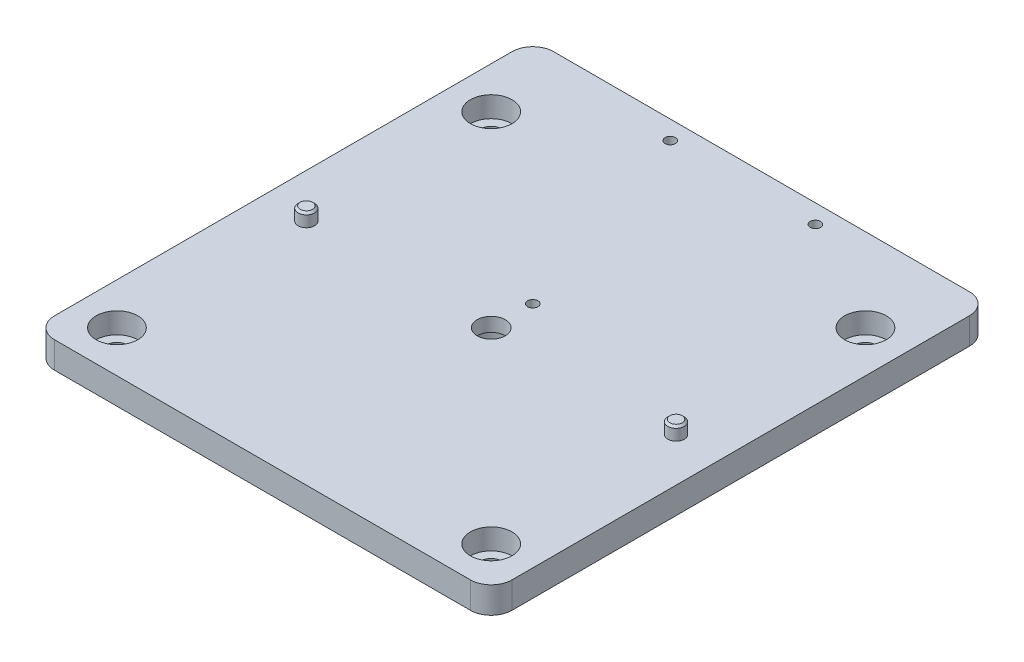
ISO-10303-21;
HEADER;
FILE_DESCRIPTION(('STEP AP214'),'2;1');
FILE_NAME('part.step','',(''),(''),'','','');
FILE_SCHEMA(('AUTOMOTIVE_DESIGN { 1 0 10303 214 1 1 1 1 }'));
ENDSEC;
DATA;
#1=APPLICATION_CONTEXT('core data for automotive mechanical design processes');
#2=APPLICATION_PROTOCOL_DEFINITION('international standard','automotive_design',2000,#1);
#3=PRODUCT_CONTEXT('',#1,'mechanical');
#4=PRODUCT('Part','Part','',(#3));
#5=PRODUCT_RELATED_PRODUCT_CATEGORY('part','',(#4));
#6=PRODUCT_DEFINITION_FORMATION('','',#4);
#7=PRODUCT_DEFINITION_CONTEXT('part definition',#1,'design');
#8=PRODUCT_DEFINITION('design','',#6,#7);
#9=PRODUCT_DEFINITION_SHAPE('','',#8);
#10=(LENGTH_UNIT() NAMED_UNIT(*) SI_UNIT(.MILLI.,.METRE.));
#11=(NAMED_UNIT(*) PLANE_ANGLE_UNIT() SI_UNIT($,.RADIAN.));
#12=(NAMED_UNIT(*) SI_UNIT($,.STERADIAN.) SOLID_ANGLE_UNIT());
#13=UNCERTAINTY_MEASURE_WITH_UNIT(LENGTH_MEASURE(1.E-05),#10,'distance_accuracy_value','');
#14=(GEOMETRIC_REPRESENTATION_CONTEXT(3) GLOBAL_UNCERTAINTY_ASSIGNED_CONTEXT((#13)) GLOBAL_UNIT_ASSIGNED_CONTEXT((#10,
#11,#12)) REPRESENTATION_CONTEXT('',''));
#15=CARTESIAN_POINT('',(0.,0.,0.));
#16=DIRECTION('',(0.,0.,1.));
#17=DIRECTION('',(1.,0.,0.));
#18=AXIS2_PLACEMENT_3D('',#15,#16,#17);
#19=CARTESIAN_POINT('',(-44.45,9.525,0.));
#20=DIRECTION('',(0.,-1.,0.));
#21=DIRECTION('',(0.,0.,-1.));
#22=AXIS2_PLACEMENT_3D('',#19,#20,#21);
#23=CYLINDRICAL_SURFACE('',#22,1.984375);
#24=CARTESIAN_POINT('',(-44.45,0.500000000000006,0.));
#25=DIRECTION('',(0.,1.,0.));
#26=DIRECTION('',(0.,0.,1.));
#27=AXIS2_PLACEMENT_3D('',#24,#25,#26);
#28=CIRCLE('',#27,1.984375);
#29=CARTESIAN_POINT('',(-44.45,0.500000000000006,1.98437500000001));
#30=VERTEX_POINT('',#29);
#31=EDGE_CURVE('E53',#30,#30,#28,.T.);
#32=ORIENTED_EDGE('',*,*,#31,.T.);
#33=EDGE_LOOP('',(#32));
#34=FACE_BOUND('',#33,.T.);
#35=CARTESIAN_POINT('',(-44.45,9.025,0.));
#36=DIRECTION('',(0.,1.,0.));
#37=DIRECTION('',(0.,0.,1.));
#38=AXIS2_PLACEMENT_3D('',#35,#36,#37);
#39=CIRCLE('',#38,1.984375);
#40=CARTESIAN_POINT('',(-44.45,9.025,1.98437500000001));
#41=VERTEX_POINT('',#40);
#42=EDGE_CURVE('E57',#41,#41,#39,.F.);
#43=ORIENTED_EDGE('',*,*,#42,.T.);
#44=EDGE_LOOP('',(#43));
#45=FACE_BOUND('',#44,.T.);
#46=ADVANCED_FACE('F42',(#34,#45),#23,.T.);
#47=CARTESIAN_POINT('',(-44.45,9.525,0.));
#48=DIRECTION('',(0.,1.,0.));
#49=DIRECTION('',(0.,0.,1.));
#50=AXIS2_PLACEMENT_3D('',#47,#48,#49);
#51=PLANE('',#50);
#52=CARTESIAN_POINT('',(-44.45,9.525,0.));
#53=DIRECTION('',(0.,1.,0.));
#54=DIRECTION('',(0.,0.,1.));
#55=AXIS2_PLACEMENT_3D('',#52,#53,#54);
#56=CIRCLE('',#55,1.484375);
#57=CARTESIAN_POINT('',(-44.45,9.525,1.48437500000001));
#58=VERTEX_POINT('',#57);
#59=EDGE_CURVE('E11',#58,#58,#56,.T.);
#60=ORIENTED_EDGE('',*,*,#59,.T.);
#61=EDGE_LOOP('',(#60));
#62=FACE_BOUND('',#61,.T.);
#63=ADVANCED_FACE('F73',(#62),#51,.T.);
#64=CARTESIAN_POINT('',(-44.45,0.,0.));
#65=DIRECTION('',(0.,1.,0.));
#66=DIRECTION('',(0.,0.,1.));
#67=AXIS2_PLACEMENT_3D('',#64,#65,#66);
#68=PLANE('',#67);
#69=CARTESIAN_POINT('',(-44.45,0.,0.));
#70=DIRECTION('',(0.,1.,0.));
#71=DIRECTION('',(0.,0.,1.));
#72=AXIS2_PLACEMENT_3D('',#69,#70,#71);
#73=CIRCLE('',#72,1.48437499999999);
#74=CARTESIAN_POINT('',(-44.45,0.,1.484375));
#75=VERTEX_POINT('',#74);
#76=EDGE_CURVE('E49',#75,#75,#73,.F.);
#77=ORIENTED_EDGE('',*,*,#76,.T.);
#78=EDGE_LOOP('',(#77));
#79=FACE_BOUND('',#78,.T.);
#80=ADVANCED_FACE('F70',(#79),#68,.F.);
#81=CARTESIAN_POINT('',(-44.45,0.500000000000006,0.));
#82=DIRECTION('',(0.,1.,0.));
#83=DIRECTION('',(0.,0.,1.));
#84=AXIS2_PLACEMENT_3D('',#81,#82,#83);
#85=CONICAL_SURFACE('',#84,1.984375,0.785398163397449);
#86=ORIENTED_EDGE('',*,*,#76,.F.);
#87=EDGE_LOOP('',(#86));
#88=FACE_BOUND('',#87,.T.);
#89=ORIENTED_EDGE('',*,*,#31,.F.);
#90=EDGE_LOOP('',(#89));
#91=FACE_BOUND('',#90,.T.);
#92=ADVANCED_FACE('F66',(#88,#91),#85,.T.);
#93=CARTESIAN_POINT('',(-44.45,9.525,0.));
#94=DIRECTION('',(0.,-1.,0.));
#95=DIRECTION('',(0.,0.,-1.));
#96=AXIS2_PLACEMENT_3D('',#93,#94,#95);
#97=CONICAL_SURFACE('',#96,1.484375,0.785398163397446);
#98=ORIENTED_EDGE('',*,*,#42,.F.);
#99=EDGE_LOOP('',(#98));
#100=FACE_BOUND('',#99,.T.);
#101=ORIENTED_EDGE('',*,*,#59,.F.);
#102=EDGE_LOOP('',(#101));
#103=FACE_BOUND('',#102,.T.);
#104=ADVANCED_FACE('F44',(#100,#103),#97,.T.);
#105=CLOSED_SHELL('',(#46,#63,#80,#92,#104));
#106=MANIFOLD_SOLID_BREP('B2',#105);
#107=CARTESIAN_POINT('',(44.45,9.525,0.));
#108=DIRECTION('',(0.,-1.,0.));
#109=DIRECTION('',(0.,0.,-1.));
#110=AXIS2_PLACEMENT_3D('',#107,#108,#109);
#111=CYLINDRICAL_SURFACE('',#110,1.984375);
#112=CARTESIAN_POINT('',(44.45,0.500000000000006,0.));
#113=DIRECTION('',(0.,1.,0.));
#114=DIRECTION('',(0.,0.,1.));
#115=AXIS2_PLACEMENT_3D('',#112,#113,#114);
#116=CIRCLE('',#115,1.984375);
#117=CARTESIAN_POINT('',(44.45,0.500000000000006,1.984375));
#118=VERTEX_POINT('',#117);
#119=EDGE_CURVE('E133',#118,#118,#116,.T.);
#120=ORIENTED_EDGE('',*,*,#119,.T.);
#121=EDGE_LOOP('',(#120));
#122=FACE_BOUND('',#121,.T.);
#123=CARTESIAN_POINT('',(44.45,9.025,0.));
#124=DIRECTION('',(0.,1.,0.));
#125=DIRECTION('',(0.,0.,1.));
#126=AXIS2_PLACEMENT_3D('',#123,#124,#125);
#127=CIRCLE('',#126,1.984375);
#128=CARTESIAN_POINT('',(44.45,9.025,1.984375));
#129=VERTEX_POINT('',#128);
#130=EDGE_CURVE('E137',#129,#129,#127,.F.);
#131=ORIENTED_EDGE('',*,*,#130,.T.);
#132=EDGE_LOOP('',(#131));
#133=FACE_BOUND('',#132,.T.);
#134=ADVANCED_FACE('F122',(#122,#133),#111,.T.);
#135=CARTESIAN_POINT('',(44.45,9.525,0.));
#136=DIRECTION('',(0.,1.,0.));
#137=DIRECTION('',(0.,0.,1.));
#138=AXIS2_PLACEMENT_3D('',#135,#136,#137);
#139=PLANE('',#138);
#140=CARTESIAN_POINT('',(44.45,9.525,0.));
#141=DIRECTION('',(0.,1.,0.));
#142=DIRECTION('',(0.,0.,1.));
#143=AXIS2_PLACEMENT_3D('',#140,#141,#142);
#144=CIRCLE('',#143,1.484375);
#145=CARTESIAN_POINT('',(44.45,9.525,1.484375));
#146=VERTEX_POINT('',#145);
#147=EDGE_CURVE('E41',#146,#146,#144,.T.);
#148=ORIENTED_EDGE('',*,*,#147,.T.);
#149=EDGE_LOOP('',(#148));
#150=FACE_BOUND('',#149,.T.);
#151=ADVANCED_FACE('F153',(#150),#139,.T.);
#152=CARTESIAN_POINT('',(44.45,0.,0.));
#153=DIRECTION('',(0.,1.,0.));
#154=DIRECTION('',(0.,0.,1.));
#155=AXIS2_PLACEMENT_3D('',#152,#153,#154);
#156=PLANE('',#155);
#157=CARTESIAN_POINT('',(44.45,0.,0.));
#158=DIRECTION('',(0.,1.,0.));
#159=DIRECTION('',(0.,0.,1.));
#160=AXIS2_PLACEMENT_3D('',#157,#158,#159);
#161=CIRCLE('',#160,1.48437499999999);
#162=CARTESIAN_POINT('',(44.45,0.,1.48437499999999));
#163=VERTEX_POINT('',#162);
#164=EDGE_CURVE('E129',#163,#163,#161,.F.);
#165=ORIENTED_EDGE('',*,*,#164,.T.);
#166=EDGE_LOOP('',(#165));
#167=FACE_BOUND('',#166,.T.);
#168=ADVANCED_FACE('F150',(#167),#156,.F.);
#169=CARTESIAN_POINT('',(44.45,0.500000000000006,0.));
#170=DIRECTION('',(0.,1.,0.));
#171=DIRECTION('',(0.,0.,1.));
#172=AXIS2_PLACEMENT_3D('',#169,#170,#171);
#173=CONICAL_SURFACE('',#172,1.984375,0.785398163397449);
#174=ORIENTED_EDGE('',*,*,#164,.F.);
#175=EDGE_LOOP('',(#174));
#176=FACE_BOUND('',#175,.T.);
#177=ORIENTED_EDGE('',*,*,#119,.F.);
#178=EDGE_LOOP('',(#177));
#179=FACE_BOUND('',#178,.T.);
#180=ADVANCED_FACE('F146',(#176,#179),#173,.T.);
#181=CARTESIAN_POINT('',(44.45,9.525,0.));
#182=DIRECTION('',(0.,-1.,0.));
#183=DIRECTION('',(0.,0.,-1.));
#184=AXIS2_PLACEMENT_3D('',#181,#182,#183);
#185=CONICAL_SURFACE('',#184,1.484375,0.785398163397446);
#186=ORIENTED_EDGE('',*,*,#130,.F.);
#187=EDGE_LOOP('',(#186));
#188=FACE_BOUND('',#187,.T.);
#189=ORIENTED_EDGE('',*,*,#147,.F.);
#190=EDGE_LOOP('',(#189));
#191=FACE_BOUND('',#190,.T.);
#192=ADVANCED_FACE('F124',(#188,#191),#185,.T.);
#193=CLOSED_SHELL('',(#134,#151,#168,#180,#192));
#194=MANIFOLD_SOLID_BREP('B6',#193);
#195=CARTESIAN_POINT('',(-50.,6.35,50.));
#196=DIRECTION('',(0.,-1.,0.));
#197=DIRECTION('',(0.,0.,-1.));
#198=AXIS2_PLACEMENT_3D('',#195,#196,#197);
#199=CYLINDRICAL_SURFACE('',#198,5.);
#200=CARTESIAN_POINT('',(-50.,0.,50.));
#201=DIRECTION('',(0.,1.,0.));
#202=DIRECTION('',(0.,0.,1.));
#203=AXIS2_PLACEMENT_3D('',#200,#201,#202);
#204=CIRCLE('',#203,5.);
#205=CARTESIAN_POINT('',(-55.,0.,50.));
#206=VERTEX_POINT('',#205);
#207=CARTESIAN_POINT('',(-50.,0.,55.));
#208=VERTEX_POINT('',#207);
#209=EDGE_CURVE('E282',#206,#208,#204,.T.);
#210=ORIENTED_EDGE('',*,*,#209,.T.);
#211=DIRECTION('',(0.,-1.,0.));
#212=VECTOR('',#211,1.);
#213=CARTESIAN_POINT('',(-50.,6.35,55.));
#214=LINE('',#213,#212);
#215=CARTESIAN_POINT('',(-50.,6.35,55.));
#216=VERTEX_POINT('',#215);
#217=EDGE_CURVE('E263',#216,#208,#214,.T.);
#218=ORIENTED_EDGE('',*,*,#217,.F.);
#219=CARTESIAN_POINT('',(-50.,6.35,50.));
#220=DIRECTION('',(0.,1.,0.));
#221=DIRECTION('',(0.,0.,1.));
#222=AXIS2_PLACEMENT_3D('',#219,#220,#221);
#223=CIRCLE('',#222,5.);
#224=CARTESIAN_POINT('',(-55.,6.35,50.));
#225=VERTEX_POINT('',#224);
#226=EDGE_CURVE('E270',#225,#216,#223,.T.);
#227=ORIENTED_EDGE('',*,*,#226,.F.);
#228=DIRECTION('',(0.,-1.,0.));
#229=VECTOR('',#228,1.);
#230=CARTESIAN_POINT('',(-55.,6.35,50.));
#231=LINE('',#230,#229);
#232=EDGE_CURVE('E334',#225,#206,#231,.T.);
#233=ORIENTED_EDGE('',*,*,#232,.T.);
#234=EDGE_LOOP('',(#210,#218,#227,#233));
#235=FACE_BOUND('',#234,.T.);
#236=ADVANCED_FACE('F193',(#235),#199,.T.);
#237=CARTESIAN_POINT('',(-50.,6.35,55.));
#238=DIRECTION('',(0.,0.,-1.));
#239=DIRECTION('',(-1.,0.,0.));
#240=AXIS2_PLACEMENT_3D('',#237,#238,#239);
#241=PLANE('',#240);
#242=DIRECTION('',(1.,0.,0.));
#243=VECTOR('',#242,1.);
#244=CARTESIAN_POINT('',(-50.,0.,55.));
#245=LINE('',#244,#243);
#246=CARTESIAN_POINT('',(50.,0.,55.));
#247=VERTEX_POINT('',#246);
#248=EDGE_CURVE('E343',#208,#247,#245,.T.);
#249=ORIENTED_EDGE('',*,*,#248,.T.);
#250=DIRECTION('',(0.,-1.,0.));
#251=VECTOR('',#250,1.);
#252=CARTESIAN_POINT('',(50.,6.35,55.));
#253=LINE('',#252,#251);
#254=CARTESIAN_POINT('',(50.,6.35,55.));
#255=VERTEX_POINT('',#254);
#256=EDGE_CURVE('E266',#255,#247,#253,.T.);
#257=ORIENTED_EDGE('',*,*,#256,.F.);
#258=DIRECTION('',(1.,0.,0.));
#259=VECTOR('',#258,1.);
#260=CARTESIAN_POINT('',(-50.,6.35,55.));
#261=LINE('',#260,#259);
#262=EDGE_CURVE('E259',#216,#255,#261,.T.);
#263=ORIENTED_EDGE('',*,*,#262,.F.);
#264=ORIENTED_EDGE('',*,*,#217,.T.);
#265=EDGE_LOOP('',(#249,#257,#263,#264));
#266=FACE_BOUND('',#265,.T.);
#267=ADVANCED_FACE('F261',(#266),#241,.F.);
#268=CARTESIAN_POINT('',(50.,6.35,50.));
#269=DIRECTION('',(0.,-1.,0.));
#270=DIRECTION('',(0.,0.,-1.));
#271=AXIS2_PLACEMENT_3D('',#268,#269,#270);
#272=CYLINDRICAL_SURFACE('',#271,5.);
#273=CARTESIAN_POINT('',(50.,0.,50.));
#274=DIRECTION('',(0.,1.,0.));
#275=DIRECTION('',(0.,0.,1.));
#276=AXIS2_PLACEMENT_3D('',#273,#274,#275);
#277=CIRCLE('',#276,5.);
#278=CARTESIAN_POINT('',(55.,0.,50.));
#279=VERTEX_POINT('',#278);
#280=EDGE_CURVE('E346',#247,#279,#277,.T.);
#281=ORIENTED_EDGE('',*,*,#280,.T.);
#282=DIRECTION('',(0.,-1.,0.));
#283=VECTOR('',#282,1.);
#284=CARTESIAN_POINT('',(55.,6.35,50.));
#285=LINE('',#284,#283);
#286=CARTESIAN_POINT('',(55.,6.35,50.));
#287=VERTEX_POINT('',#286);
#288=EDGE_CURVE('E288',#287,#279,#285,.T.);
#289=ORIENTED_EDGE('',*,*,#288,.F.);
#290=CARTESIAN_POINT('',(50.,6.35,50.));
#291=DIRECTION('',(0.,1.,0.));
#292=DIRECTION('',(0.,0.,1.));
#293=AXIS2_PLACEMENT_3D('',#290,#291,#292);
#294=CIRCLE('',#293,5.);
#295=EDGE_CURVE('E269',#255,#287,#294,.T.);
#296=ORIENTED_EDGE('',*,*,#295,.F.);
#297=ORIENTED_EDGE('',*,*,#256,.T.);
#298=EDGE_LOOP('',(#281,#289,#296,#297));
#299=FACE_BOUND('',#298,.T.);
#300=ADVANCED_FACE('F358',(#299),#272,.T.);
#301=CARTESIAN_POINT('',(55.,6.35,50.));
#302=DIRECTION('',(-1.,0.,0.));
#303=DIRECTION('',(0.,0.,1.));
#304=AXIS2_PLACEMENT_3D('',#301,#302,#303);
#305=PLANE('',#304);
#306=DIRECTION('',(0.,0.,-1.));
#307=VECTOR('',#306,1.);
#308=CARTESIAN_POINT('',(55.,0.,50.));
#309=LINE('',#308,#307);
#310=CARTESIAN_POINT('',(55.,0.,-60.));
#311=VERTEX_POINT('',#310);
#312=EDGE_CURVE('E348',#279,#311,#309,.T.);
#313=ORIENTED_EDGE('',*,*,#312,.T.);
#314=DIRECTION('',(0.,-1.,0.));
#315=VECTOR('',#314,1.);
#316=CARTESIAN_POINT('',(55.,6.35,-60.));
#317=LINE('',#316,#315);
#318=CARTESIAN_POINT('',(55.,6.35,-60.));
#319=VERTEX_POINT('',#318);
#320=EDGE_CURVE('E120',#311,#319,#317,.F.);
#321=ORIENTED_EDGE('',*,*,#320,.T.);
#322=DIRECTION('',(0.,0.,-1.));
#323=VECTOR('',#322,1.);
#324=CARTESIAN_POINT('',(55.,6.35,50.));
#325=LINE('',#324,#323);
#326=EDGE_CURVE('E335',#287,#319,#325,.T.);
#327=ORIENTED_EDGE('',*,*,#326,.F.);
#328=ORIENTED_EDGE('',*,*,#288,.T.);
#329=EDGE_LOOP('',(#313,#321,#327,#328));
#330=FACE_BOUND('',#329,.T.);
#331=ADVANCED_FACE('F354',(#330),#305,.F.);
#332=CARTESIAN_POINT('',(-55.,6.35,50.));
#333=DIRECTION('',(1.,0.,0.));
#334=DIRECTION('',(0.,0.,-1.));
#335=AXIS2_PLACEMENT_3D('',#332,#333,#334);
#336=PLANE('',#335);
#337=DIRECTION('',(0.,0.,1.));
#338=VECTOR('',#337,1.);
#339=CARTESIAN_POINT('',(-55.,6.35,50.));
#340=LINE('',#339,#338);
#341=CARTESIAN_POINT('',(-55.,6.35,-60.));
#342=VERTEX_POINT('',#341);
#343=EDGE_CURVE('E275',#342,#225,#340,.T.);
#344=ORIENTED_EDGE('',*,*,#343,.F.);
#345=DIRECTION('',(0.,1.,0.));
#346=VECTOR('',#345,1.);
#347=CARTESIAN_POINT('',(-55.,6.35,-60.));
#348=LINE('',#347,#346);
#349=CARTESIAN_POINT('',(-55.,0.,-60.));
#350=VERTEX_POINT('',#349);
#351=EDGE_CURVE('E216',#342,#350,#348,.F.);
#352=ORIENTED_EDGE('',*,*,#351,.T.);
#353=DIRECTION('',(0.,0.,1.));
#354=VECTOR('',#353,1.);
#355=CARTESIAN_POINT('',(-55.,0.,50.));
#356=LINE('',#355,#354);
#357=EDGE_CURVE('E279',#350,#206,#356,.T.);
#358=ORIENTED_EDGE('',*,*,#357,.T.);
#359=ORIENTED_EDGE('',*,*,#232,.F.);
#360=EDGE_LOOP('',(#344,#352,#358,#359));
#361=FACE_BOUND('',#360,.T.);
#362=ADVANCED_FACE('F333',(#361),#336,.F.);
#363=CARTESIAN_POINT('',(-50.,6.35,50.));
#364=DIRECTION('',(0.,1.,0.));
#365=DIRECTION('',(0.,0.,1.));
#366=AXIS2_PLACEMENT_3D('',#363,#364,#365);
#367=PLANE('',#366);
#368=CARTESIAN_POINT('',(17.45,6.35,-60.4999999999998));
#369=DIRECTION('',(0.,-1.,0.));
#370=DIRECTION('',(0.,0.,-1.));
#371=AXIS2_PLACEMENT_3D('',#368,#369,#370);
#372=CIRCLE('',#371,1.25);
#373=CARTESIAN_POINT('',(17.45,6.35,-61.7499999999998));
#374=VERTEX_POINT('',#373);
#375=EDGE_CURVE('E423',#374,#374,#372,.T.);
#376=ORIENTED_EDGE('',*,*,#375,.T.);
#377=EDGE_LOOP('',(#376));
#378=FACE_BOUND('',#377,.T.);
#379=CARTESIAN_POINT('',(-17.45,6.35,-60.4999999999998));
#380=DIRECTION('',(0.,-1.,0.));
#381=DIRECTION('',(0.,0.,-1.));
#382=AXIS2_PLACEMENT_3D('',#379,#380,#381);
#383=CIRCLE('',#382,1.25);
#384=CARTESIAN_POINT('',(-17.45,6.35,-61.7499999999998));
#385=VERTEX_POINT('',#384);
#386=EDGE_CURVE('E417',#385,#385,#383,.T.);
#387=ORIENTED_EDGE('',*,*,#386,.T.);
#388=EDGE_LOOP('',(#387));
#389=FACE_BOUND('',#388,.T.);
#390=CARTESIAN_POINT('',(0.,6.35,-10.));
#391=DIRECTION('',(0.,-1.,0.));
#392=DIRECTION('',(0.,0.,-1.));
#393=AXIS2_PLACEMENT_3D('',#390,#391,#392);
#394=CIRCLE('',#393,1.25);
#395=CARTESIAN_POINT('',(0.,6.35,-11.25));
#396=VERTEX_POINT('',#395);
#397=EDGE_CURVE('E411',#396,#396,#394,.T.);
#398=ORIENTED_EDGE('',*,*,#397,.T.);
#399=EDGE_LOOP('',(#398));
#400=FACE_BOUND('',#399,.T.);
#401=CARTESIAN_POINT('',(-44.45,6.35,0.));
#402=DIRECTION('',(0.,1.,0.));
#403=DIRECTION('',(0.,0.,1.));
#404=AXIS2_PLACEMENT_3D('',#401,#402,#403);
#405=CIRCLE('',#404,1.984375);
#406=CARTESIAN_POINT('',(-44.45,6.35,1.98437500000001));
#407=VERTEX_POINT('',#406);
#408=EDGE_CURVE('E329',#407,#407,#405,.T.);
#409=ORIENTED_EDGE('',*,*,#408,.F.);
#410=EDGE_LOOP('',(#409));
#411=FACE_BOUND('',#410,.T.);
#412=CARTESIAN_POINT('',(44.45,6.35,0.));
#413=DIRECTION('',(0.,1.,0.));
#414=DIRECTION('',(0.,0.,1.));
#415=AXIS2_PLACEMENT_3D('',#412,#413,#414);
#416=CIRCLE('',#415,1.984375);
#417=CARTESIAN_POINT('',(44.45,6.35,1.984375));
#418=VERTEX_POINT('',#417);
#419=EDGE_CURVE('E402',#418,#418,#416,.T.);
#420=ORIENTED_EDGE('',*,*,#419,.F.);
#421=EDGE_LOOP('',(#420));
#422=FACE_BOUND('',#421,.T.);
#423=CARTESIAN_POINT('',(45.,6.35,-45.));
#424=DIRECTION('',(0.,1.,0.));
#425=DIRECTION('',(0.,0.,1.));
#426=AXIS2_PLACEMENT_3D('',#423,#424,#425);
#427=CIRCLE('',#426,5.);
#428=CARTESIAN_POINT('',(45.,6.35,-40.));
#429=VERTEX_POINT('',#428);
#430=EDGE_CURVE('E396',#429,#429,#427,.T.);
#431=ORIENTED_EDGE('',*,*,#430,.F.);
#432=EDGE_LOOP('',(#431));
#433=FACE_BOUND('',#432,.T.);
#434=CARTESIAN_POINT('',(45.,6.35,45.));
#435=DIRECTION('',(0.,1.,0.));
#436=DIRECTION('',(0.,0.,1.));
#437=AXIS2_PLACEMENT_3D('',#434,#435,#436);
#438=CIRCLE('',#437,5.);
#439=CARTESIAN_POINT('',(45.,6.35,50.));
#440=VERTEX_POINT('',#439);
#441=EDGE_CURVE('E309',#440,#440,#438,.T.);
#442=ORIENTED_EDGE('',*,*,#441,.F.);
#443=EDGE_LOOP('',(#442));
#444=FACE_BOUND('',#443,.T.);
#445=CARTESIAN_POINT('',(-45.,6.35,45.));
#446=DIRECTION('',(0.,1.,0.));
#447=DIRECTION('',(0.,0.,1.));
#448=AXIS2_PLACEMENT_3D('',#445,#446,#447);
#449=CIRCLE('',#448,5.);
#450=CARTESIAN_POINT('',(-45.,6.35,50.));
#451=VERTEX_POINT('',#450);
#452=EDGE_CURVE('E305',#451,#451,#449,.T.);
#453=ORIENTED_EDGE('',*,*,#452,.F.);
#454=EDGE_LOOP('',(#453));
#455=FACE_BOUND('',#454,.T.);
#456=CARTESIAN_POINT('',(-45.,6.35,-45.));
#457=DIRECTION('',(0.,1.,0.));
#458=DIRECTION('',(0.,0.,1.));
#459=AXIS2_PLACEMENT_3D('',#456,#457,#458);
#460=CIRCLE('',#459,5.);
#461=CARTESIAN_POINT('',(-45.,6.35,-40.));
#462=VERTEX_POINT('',#461);
#463=EDGE_CURVE('E300',#462,#462,#460,.T.);
#464=ORIENTED_EDGE('',*,*,#463,.F.);
#465=EDGE_LOOP('',(#464));
#466=FACE_BOUND('',#465,.T.);
#467=CARTESIAN_POINT('',(0.,6.35,0.));
#468=DIRECTION('',(0.,-1.,0.));
#469=DIRECTION('',(0.,0.,-1.));
#470=AXIS2_PLACEMENT_3D('',#467,#468,#469);
#471=CIRCLE('',#470,3.3782);
#472=CARTESIAN_POINT('',(0.,6.35,-3.3782));
#473=VERTEX_POINT('',#472);
#474=EDGE_CURVE('E344',#473,#473,#471,.T.);
#475=ORIENTED_EDGE('',*,*,#474,.T.);
#476=EDGE_LOOP('',(#475));
#477=FACE_BOUND('',#476,.T.);
#478=DIRECTION('',(1.,0.,0.));
#479=VECTOR('',#478,1.);
#480=CARTESIAN_POINT('',(55.,6.35,-65.));
#481=LINE('',#480,#479);
#482=CARTESIAN_POINT('',(-50.,6.35,-65.));
#483=VERTEX_POINT('',#482);
#484=CARTESIAN_POINT('',(50.,6.35,-65.));
#485=VERTEX_POINT('',#484);
#486=EDGE_CURVE('E330',#483,#485,#481,.T.);
#487=ORIENTED_EDGE('',*,*,#486,.F.);
#488=CARTESIAN_POINT('',(-50.,6.35,-60.));
#489=DIRECTION('',(0.,1.,0.));
#490=DIRECTION('',(0.,0.,1.));
#491=AXIS2_PLACEMENT_3D('',#488,#489,#490);
#492=CIRCLE('',#491,5.);
#493=EDGE_CURVE('E316',#483,#342,#492,.T.);
#494=ORIENTED_EDGE('',*,*,#493,.T.);
#495=ORIENTED_EDGE('',*,*,#343,.T.);
#496=ORIENTED_EDGE('',*,*,#226,.T.);
#497=ORIENTED_EDGE('',*,*,#262,.T.);
#498=ORIENTED_EDGE('',*,*,#295,.T.);
#499=ORIENTED_EDGE('',*,*,#326,.T.);
#500=CARTESIAN_POINT('',(50.,6.35,-60.));
#501=DIRECTION('',(0.,1.,0.));
#502=DIRECTION('',(0.,0.,1.));
#503=AXIS2_PLACEMENT_3D('',#500,#501,#502);
#504=CIRCLE('',#503,5.);
#505=EDGE_CURVE('E314',#319,#485,#504,.T.);
#506=ORIENTED_EDGE('',*,*,#505,.T.);
#507=EDGE_LOOP('',(#487,#494,#495,#496,#497,#498,#499,#506));
#508=FACE_BOUND('',#507,.T.);
#509=ADVANCED_FACE('F274',(#378,#389,#400,#411,#422,#433,#444,#455,#466,#477,#508),#367,.T.);
#510=CARTESIAN_POINT('',(-50.,0.,50.));
#511=DIRECTION('',(0.,1.,0.));
#512=DIRECTION('',(0.,0.,1.));
#513=AXIS2_PLACEMENT_3D('',#510,#511,#512);
#514=PLANE('',#513);
#515=CARTESIAN_POINT('',(17.45,0.,-60.4999999999998));
#516=DIRECTION('',(0.,-1.,0.));
#517=DIRECTION('',(0.,0.,-1.));
#518=AXIS2_PLACEMENT_3D('',#515,#516,#517);
#519=CIRCLE('',#518,1.25);
#520=CARTESIAN_POINT('',(17.45,0.,-61.7499999999998));
#521=VERTEX_POINT('',#520);
#522=EDGE_CURVE('E426',#521,#521,#519,.T.);
#523=ORIENTED_EDGE('',*,*,#522,.F.);
#524=EDGE_LOOP('',(#523));
#525=FACE_BOUND('',#524,.T.);
#526=CARTESIAN_POINT('',(-17.45,0.,-60.4999999999998));
#527=DIRECTION('',(0.,-1.,0.));
#528=DIRECTION('',(0.,0.,-1.));
#529=AXIS2_PLACEMENT_3D('',#526,#527,#528);
#530=CIRCLE('',#529,1.25);
#531=CARTESIAN_POINT('',(-17.45,0.,-61.7499999999998));
#532=VERTEX_POINT('',#531);
#533=EDGE_CURVE('E420',#532,#532,#530,.T.);
#534=ORIENTED_EDGE('',*,*,#533,.F.);
#535=EDGE_LOOP('',(#534));
#536=FACE_BOUND('',#535,.T.);
#537=CARTESIAN_POINT('',(0.,0.,-10.));
#538=DIRECTION('',(0.,-1.,0.));
#539=DIRECTION('',(0.,0.,-1.));
#540=AXIS2_PLACEMENT_3D('',#537,#538,#539);
#541=CIRCLE('',#540,1.25);
#542=CARTESIAN_POINT('',(0.,0.,-11.25));
#543=VERTEX_POINT('',#542);
#544=EDGE_CURVE('E414',#543,#543,#541,.T.);
#545=ORIENTED_EDGE('',*,*,#544,.F.);
#546=EDGE_LOOP('',(#545));
#547=FACE_BOUND('',#546,.T.);
#548=CARTESIAN_POINT('',(-44.45,0.,0.));
#549=DIRECTION('',(0.,1.,0.));
#550=DIRECTION('',(0.,0.,1.));
#551=AXIS2_PLACEMENT_3D('',#548,#549,#550);
#552=CIRCLE('',#551,1.984375);
#553=CARTESIAN_POINT('',(-44.45,0.,1.98437500000001));
#554=VERTEX_POINT('',#553);
#555=EDGE_CURVE('E405',#554,#554,#552,.T.);
#556=ORIENTED_EDGE('',*,*,#555,.T.);
#557=EDGE_LOOP('',(#556));
#558=FACE_BOUND('',#557,.T.);
#559=CARTESIAN_POINT('',(44.45,0.,0.));
#560=DIRECTION('',(0.,1.,0.));
#561=DIRECTION('',(0.,0.,1.));
#562=AXIS2_PLACEMENT_3D('',#559,#560,#561);
#563=CIRCLE('',#562,1.984375);
#564=CARTESIAN_POINT('',(44.45,0.,1.984375));
#565=VERTEX_POINT('',#564);
#566=EDGE_CURVE('E399',#565,#565,#563,.T.);
#567=ORIENTED_EDGE('',*,*,#566,.T.);
#568=EDGE_LOOP('',(#567));
#569=FACE_BOUND('',#568,.T.);
#570=CARTESIAN_POINT('',(45.,0.,-45.));
#571=DIRECTION('',(0.,1.,0.));
#572=DIRECTION('',(0.,0.,1.));
#573=AXIS2_PLACEMENT_3D('',#570,#571,#572);
#574=CIRCLE('',#573,2.75);
#575=CARTESIAN_POINT('',(45.,0.,-42.25));
#576=VERTEX_POINT('',#575);
#577=EDGE_CURVE('E307',#576,#576,#574,.T.);
#578=ORIENTED_EDGE('',*,*,#577,.T.);
#579=EDGE_LOOP('',(#578));
#580=FACE_BOUND('',#579,.T.);
#581=CARTESIAN_POINT('',(45.,0.,45.));
#582=DIRECTION('',(0.,1.,0.));
#583=DIRECTION('',(0.,0.,1.));
#584=AXIS2_PLACEMENT_3D('',#581,#582,#583);
#585=CIRCLE('',#584,2.75);
#586=CARTESIAN_POINT('',(45.,0.,47.75));
#587=VERTEX_POINT('',#586);
#588=EDGE_CURVE('E302',#587,#587,#585,.T.);
#589=ORIENTED_EDGE('',*,*,#588,.T.);
#590=EDGE_LOOP('',(#589));
#591=FACE_BOUND('',#590,.T.);
#592=CARTESIAN_POINT('',(-45.,0.,45.));
#593=DIRECTION('',(0.,1.,0.));
#594=DIRECTION('',(0.,0.,1.));
#595=AXIS2_PLACEMENT_3D('',#592,#593,#594);
#596=CIRCLE('',#595,2.75);
#597=CARTESIAN_POINT('',(-45.,0.,47.75));
#598=VERTEX_POINT('',#597);
#599=EDGE_CURVE('E297',#598,#598,#596,.T.);
#600=ORIENTED_EDGE('',*,*,#599,.T.);
#601=EDGE_LOOP('',(#600));
#602=FACE_BOUND('',#601,.T.);
#603=CARTESIAN_POINT('',(-45.,0.,-45.));
#604=DIRECTION('',(0.,1.,0.));
#605=DIRECTION('',(0.,0.,1.));
#606=AXIS2_PLACEMENT_3D('',#603,#604,#605);
#607=CIRCLE('',#606,2.75);
#608=CARTESIAN_POINT('',(-45.,0.,-42.25));
#609=VERTEX_POINT('',#608);
#610=EDGE_CURVE('E292',#609,#609,#607,.T.);
#611=ORIENTED_EDGE('',*,*,#610,.T.);
#612=EDGE_LOOP('',(#611));
#613=FACE_BOUND('',#612,.T.);
#614=CARTESIAN_POINT('',(0.,0.,0.));
#615=DIRECTION('',(0.,-1.,0.));
#616=DIRECTION('',(0.,0.,-1.));
#617=AXIS2_PLACEMENT_3D('',#614,#615,#616);
#618=CIRCLE('',#617,5.55625);
#619=CARTESIAN_POINT('',(0.,0.,-5.55625));
#620=VERTEX_POINT('',#619);
#621=EDGE_CURVE('E295',#620,#620,#618,.T.);
#622=ORIENTED_EDGE('',*,*,#621,.F.);
#623=EDGE_LOOP('',(#622));
#624=FACE_BOUND('',#623,.T.);
#625=ORIENTED_EDGE('',*,*,#357,.F.);
#626=CARTESIAN_POINT('',(-50.,0.,-60.));
#627=DIRECTION('',(0.,1.,0.));
#628=DIRECTION('',(0.,0.,1.));
#629=AXIS2_PLACEMENT_3D('',#626,#627,#628);
#630=CIRCLE('',#629,5.);
#631=CARTESIAN_POINT('',(-50.,0.,-65.));
#632=VERTEX_POINT('',#631);
#633=EDGE_CURVE('E201',#350,#632,#630,.F.);
#634=ORIENTED_EDGE('',*,*,#633,.T.);
#635=DIRECTION('',(-1.,0.,0.));
#636=VECTOR('',#635,1.);
#637=CARTESIAN_POINT('',(55.,0.,-65.));
#638=LINE('',#637,#636);
#639=CARTESIAN_POINT('',(50.,0.,-65.));
#640=VERTEX_POINT('',#639);
#641=EDGE_CURVE('E322',#640,#632,#638,.T.);
#642=ORIENTED_EDGE('',*,*,#641,.F.);
#643=CARTESIAN_POINT('',(50.,0.,-60.));
#644=DIRECTION('',(0.,1.,0.));
#645=DIRECTION('',(0.,0.,1.));
#646=AXIS2_PLACEMENT_3D('',#643,#644,#645);
#647=CIRCLE('',#646,5.);
#648=EDGE_CURVE('E208',#640,#311,#647,.F.);
#649=ORIENTED_EDGE('',*,*,#648,.T.);
#650=ORIENTED_EDGE('',*,*,#312,.F.);
#651=ORIENTED_EDGE('',*,*,#280,.F.);
#652=ORIENTED_EDGE('',*,*,#248,.F.);
#653=ORIENTED_EDGE('',*,*,#209,.F.);
#654=EDGE_LOOP('',(#625,#634,#642,#649,#650,#651,#652,#653));
#655=FACE_BOUND('',#654,.T.);
#656=ADVANCED_FACE('F321',(#525,#536,#547,#558,#569,#580,#591,#602,#613,#624,#655),#514,.F.);
#657=CARTESIAN_POINT('',(0.,0.,0.));
#658=DIRECTION('',(0.,-1.,0.));
#659=DIRECTION('',(0.,0.,-1.));
#660=AXIS2_PLACEMENT_3D('',#657,#658,#659);
#661=CYLINDRICAL_SURFACE('',#660,3.3782);
#662=ORIENTED_EDGE('',*,*,#474,.F.);
#663=EDGE_LOOP('',(#662));
#664=FACE_BOUND('',#663,.T.);
#665=CARTESIAN_POINT('',(0.,2.999994,0.));
#666=DIRECTION('',(0.,-1.,0.));
#667=DIRECTION('',(0.,0.,-1.));
#668=AXIS2_PLACEMENT_3D('',#665,#666,#667);
#669=CIRCLE('',#668,3.3782);
#670=CARTESIAN_POINT('',(0.,2.999994,-3.3782));
#671=VERTEX_POINT('',#670);
#672=EDGE_CURVE('E362',#671,#671,#669,.T.);
#673=ORIENTED_EDGE('',*,*,#672,.T.);
#674=EDGE_LOOP('',(#673));
#675=FACE_BOUND('',#674,.T.);
#676=ADVANCED_FACE('F434',(#664,#675),#661,.F.);
#677=CARTESIAN_POINT('',(3.3782,2.999994,0.));
#678=DIRECTION('',(0.,1.,0.));
#679=DIRECTION('',(0.,0.,1.));
#680=AXIS2_PLACEMENT_3D('',#677,#678,#679);
#681=PLANE('',#680);
#682=ORIENTED_EDGE('',*,*,#672,.F.);
#683=EDGE_LOOP('',(#682));
#684=FACE_BOUND('',#683,.T.);
#685=CARTESIAN_POINT('',(0.,2.999994,0.));
#686=DIRECTION('',(0.,-1.,0.));
#687=DIRECTION('',(0.,0.,-1.));
#688=AXIS2_PLACEMENT_3D('',#685,#686,#687);
#689=CIRCLE('',#688,5.55625);
#690=CARTESIAN_POINT('',(0.,2.999994,-5.55625));
#691=VERTEX_POINT('',#690);
#692=EDGE_CURVE('E365',#691,#691,#689,.T.);
#693=ORIENTED_EDGE('',*,*,#692,.T.);
#694=EDGE_LOOP('',(#693));
#695=FACE_BOUND('',#694,.T.);
#696=ADVANCED_FACE('F457',(#684,#695),#681,.F.);
#697=CARTESIAN_POINT('',(0.,0.,0.));
#698=DIRECTION('',(0.,-1.,0.));
#699=DIRECTION('',(0.,0.,-1.));
#700=AXIS2_PLACEMENT_3D('',#697,#698,#699);
#701=CYLINDRICAL_SURFACE('',#700,5.55625);
#702=ORIENTED_EDGE('',*,*,#692,.F.);
#703=EDGE_LOOP('',(#702));
#704=FACE_BOUND('',#703,.T.);
#705=ORIENTED_EDGE('',*,*,#621,.T.);
#706=EDGE_LOOP('',(#705));
#707=FACE_BOUND('',#706,.T.);
#708=ADVANCED_FACE('F454',(#704,#707),#701,.F.);
#709=CARTESIAN_POINT('',(-45.,6.35,-45.));
#710=DIRECTION('',(0.,1.,0.));
#711=DIRECTION('',(0.,0.,1.));
#712=AXIS2_PLACEMENT_3D('',#709,#710,#711);
#713=CYLINDRICAL_SURFACE('',#712,2.75);
#714=CARTESIAN_POINT('',(-45.,1.35,-45.));
#715=DIRECTION('',(0.,1.,0.));
#716=DIRECTION('',(0.,0.,1.));
#717=AXIS2_PLACEMENT_3D('',#714,#715,#716);
#718=CIRCLE('',#717,2.75);
#719=CARTESIAN_POINT('',(-45.,1.35,-42.25));
#720=VERTEX_POINT('',#719);
#721=EDGE_CURVE('E296',#720,#720,#718,.T.);
#722=ORIENTED_EDGE('',*,*,#721,.T.);
#723=EDGE_LOOP('',(#722));
#724=FACE_BOUND('',#723,.T.);
#725=ORIENTED_EDGE('',*,*,#610,.F.);
#726=EDGE_LOOP('',(#725));
#727=FACE_BOUND('',#726,.T.);
#728=ADVANCED_FACE('F456',(#724,#727),#713,.F.);
#729=CARTESIAN_POINT('',(-42.25,1.35,-45.));
#730=DIRECTION('',(0.,-1.,0.));
#731=DIRECTION('',(0.,0.,-1.));
#732=AXIS2_PLACEMENT_3D('',#729,#730,#731);
#733=PLANE('',#732);
#734=ORIENTED_EDGE('',*,*,#721,.F.);
#735=EDGE_LOOP('',(#734));
#736=FACE_BOUND('',#735,.T.);
#737=CARTESIAN_POINT('',(-45.,1.35,-45.));
#738=DIRECTION('',(0.,1.,0.));
#739=DIRECTION('',(0.,0.,1.));
#740=AXIS2_PLACEMENT_3D('',#737,#738,#739);
#741=CIRCLE('',#740,5.);
#742=CARTESIAN_POINT('',(-45.,1.35,-40.));
#743=VERTEX_POINT('',#742);
#744=EDGE_CURVE('E372',#743,#743,#741,.T.);
#745=ORIENTED_EDGE('',*,*,#744,.T.);
#746=EDGE_LOOP('',(#745));
#747=FACE_BOUND('',#746,.T.);
#748=ADVANCED_FACE('F464',(#736,#747),#733,.F.);
#749=CARTESIAN_POINT('',(-45.,6.35,-45.));
#750=DIRECTION('',(0.,1.,0.));
#751=DIRECTION('',(0.,0.,1.));
#752=AXIS2_PLACEMENT_3D('',#749,#750,#751);
#753=CYLINDRICAL_SURFACE('',#752,5.);
#754=ORIENTED_EDGE('',*,*,#744,.F.);
#755=EDGE_LOOP('',(#754));
#756=FACE_BOUND('',#755,.T.);
#757=ORIENTED_EDGE('',*,*,#463,.T.);
#758=EDGE_LOOP('',(#757));
#759=FACE_BOUND('',#758,.T.);
#760=ADVANCED_FACE('F533',(#756,#759),#753,.F.);
#761=CARTESIAN_POINT('',(-45.,6.35,45.));
#762=DIRECTION('',(0.,1.,0.));
#763=DIRECTION('',(0.,0.,1.));
#764=AXIS2_PLACEMENT_3D('',#761,#762,#763);
#765=CYLINDRICAL_SURFACE('',#764,2.75);
#766=CARTESIAN_POINT('',(-45.,1.35,45.));
#767=DIRECTION('',(0.,1.,0.));
#768=DIRECTION('',(0.,0.,1.));
#769=AXIS2_PLACEMENT_3D('',#766,#767,#768);
#770=CIRCLE('',#769,2.75);
#771=CARTESIAN_POINT('',(-45.,1.35,47.75));
#772=VERTEX_POINT('',#771);
#773=EDGE_CURVE('E301',#772,#772,#770,.T.);
#774=ORIENTED_EDGE('',*,*,#773,.T.);
#775=EDGE_LOOP('',(#774));
#776=FACE_BOUND('',#775,.T.);
#777=ORIENTED_EDGE('',*,*,#599,.F.);
#778=EDGE_LOOP('',(#777));
#779=FACE_BOUND('',#778,.T.);
#780=ADVANCED_FACE('F529',(#776,#779),#765,.F.);
#781=CARTESIAN_POINT('',(-42.25,1.35,45.));
#782=DIRECTION('',(0.,-1.,0.));
#783=DIRECTION('',(0.,0.,-1.));
#784=AXIS2_PLACEMENT_3D('',#781,#782,#783);
#785=PLANE('',#784);
#786=ORIENTED_EDGE('',*,*,#773,.F.);
#787=EDGE_LOOP('',(#786));
#788=FACE_BOUND('',#787,.T.);
#789=CARTESIAN_POINT('',(-45.,1.35,45.));
#790=DIRECTION('',(0.,1.,0.));
#791=DIRECTION('',(0.,0.,1.));
#792=AXIS2_PLACEMENT_3D('',#789,#790,#791);
#793=CIRCLE('',#792,5.);
#794=CARTESIAN_POINT('',(-45.,1.35,50.));
#795=VERTEX_POINT('',#794);
#796=EDGE_CURVE('E379',#795,#795,#793,.T.);
#797=ORIENTED_EDGE('',*,*,#796,.T.);
#798=EDGE_LOOP('',(#797));
#799=FACE_BOUND('',#798,.T.);
#800=ADVANCED_FACE('F525',(#788,#799),#785,.F.);
#801=CARTESIAN_POINT('',(-45.,6.35,45.));
#802=DIRECTION('',(0.,1.,0.));
#803=DIRECTION('',(0.,0.,1.));
#804=AXIS2_PLACEMENT_3D('',#801,#802,#803);
#805=CYLINDRICAL_SURFACE('',#804,5.);
#806=ORIENTED_EDGE('',*,*,#796,.F.);
#807=EDGE_LOOP('',(#806));
#808=FACE_BOUND('',#807,.T.);
#809=ORIENTED_EDGE('',*,*,#452,.T.);
#810=EDGE_LOOP('',(#809));
#811=FACE_BOUND('',#810,.T.);
#812=ADVANCED_FACE('F521',(#808,#811),#805,.F.);
#813=CARTESIAN_POINT('',(45.,6.35,45.));
#814=DIRECTION('',(0.,1.,0.));
#815=DIRECTION('',(0.,0.,1.));
#816=AXIS2_PLACEMENT_3D('',#813,#814,#815);
#817=CYLINDRICAL_SURFACE('',#816,2.75);
#818=CARTESIAN_POINT('',(45.,1.35,45.));
#819=DIRECTION('',(0.,1.,0.));
#820=DIRECTION('',(0.,0.,1.));
#821=AXIS2_PLACEMENT_3D('',#818,#819,#820);
#822=CIRCLE('',#821,2.75);
#823=CARTESIAN_POINT('',(45.,1.35,47.75));
#824=VERTEX_POINT('',#823);
#825=EDGE_CURVE('E306',#824,#824,#822,.T.);
#826=ORIENTED_EDGE('',*,*,#825,.T.);
#827=EDGE_LOOP('',(#826));
#828=FACE_BOUND('',#827,.T.);
#829=ORIENTED_EDGE('',*,*,#588,.F.);
#830=EDGE_LOOP('',(#829));
#831=FACE_BOUND('',#830,.T.);
#832=ADVANCED_FACE('F517',(#828,#831),#817,.F.);
#833=CARTESIAN_POINT('',(47.75,1.35,45.));
#834=DIRECTION('',(0.,-1.,0.));
#835=DIRECTION('',(0.,0.,-1.));
#836=AXIS2_PLACEMENT_3D('',#833,#834,#835);
#837=PLANE('',#836);
#838=ORIENTED_EDGE('',*,*,#825,.F.);
#839=EDGE_LOOP('',(#838));
#840=FACE_BOUND('',#839,.T.);
#841=CARTESIAN_POINT('',(45.,1.35,45.));
#842=DIRECTION('',(0.,1.,0.));
#843=DIRECTION('',(0.,0.,1.));
#844=AXIS2_PLACEMENT_3D('',#841,#842,#843);
#845=CIRCLE('',#844,5.);
#846=CARTESIAN_POINT('',(45.,1.35,50.));
#847=VERTEX_POINT('',#846);
#848=EDGE_CURVE('E386',#847,#847,#845,.T.);
#849=ORIENTED_EDGE('',*,*,#848,.T.);
#850=EDGE_LOOP('',(#849));
#851=FACE_BOUND('',#850,.T.);
#852=ADVANCED_FACE('F513',(#840,#851),#837,.F.);
#853=CARTESIAN_POINT('',(45.,6.35,45.));
#854=DIRECTION('',(0.,1.,0.));
#855=DIRECTION('',(0.,0.,1.));
#856=AXIS2_PLACEMENT_3D('',#853,#854,#855);
#857=CYLINDRICAL_SURFACE('',#856,5.);
#858=ORIENTED_EDGE('',*,*,#848,.F.);
#859=EDGE_LOOP('',(#858));
#860=FACE_BOUND('',#859,.T.);
#861=ORIENTED_EDGE('',*,*,#441,.T.);
#862=EDGE_LOOP('',(#861));
#863=FACE_BOUND('',#862,.T.);
#864=ADVANCED_FACE('F509',(#860,#863),#857,.F.);
#865=CARTESIAN_POINT('',(45.,6.35,-45.));
#866=DIRECTION('',(0.,1.,0.));
#867=DIRECTION('',(0.,0.,1.));
#868=AXIS2_PLACEMENT_3D('',#865,#866,#867);
#869=CYLINDRICAL_SURFACE('',#868,2.75);
#870=CARTESIAN_POINT('',(45.,1.35,-45.));
#871=DIRECTION('',(0.,1.,0.));
#872=DIRECTION('',(0.,0.,1.));
#873=AXIS2_PLACEMENT_3D('',#870,#871,#872);
#874=CIRCLE('',#873,2.75);
#875=CARTESIAN_POINT('',(45.,1.35,-42.25));
#876=VERTEX_POINT('',#875);
#877=EDGE_CURVE('E310',#876,#876,#874,.T.);
#878=ORIENTED_EDGE('',*,*,#877,.T.);
#879=EDGE_LOOP('',(#878));
#880=FACE_BOUND('',#879,.T.);
#881=ORIENTED_EDGE('',*,*,#577,.F.);
#882=EDGE_LOOP('',(#881));
#883=FACE_BOUND('',#882,.T.);
#884=ADVANCED_FACE('F505',(#880,#883),#869,.F.);
#885=CARTESIAN_POINT('',(47.75,1.35,-45.));
#886=DIRECTION('',(0.,-1.,0.));
#887=DIRECTION('',(0.,0.,-1.));
#888=AXIS2_PLACEMENT_3D('',#885,#886,#887);
#889=PLANE('',#888);
#890=ORIENTED_EDGE('',*,*,#877,.F.);
#891=EDGE_LOOP('',(#890));
#892=FACE_BOUND('',#891,.T.);
#893=CARTESIAN_POINT('',(45.,1.35,-45.));
#894=DIRECTION('',(0.,1.,0.));
#895=DIRECTION('',(0.,0.,1.));
#896=AXIS2_PLACEMENT_3D('',#893,#894,#895);
#897=CIRCLE('',#896,5.);
#898=CARTESIAN_POINT('',(45.,1.35,-40.));
#899=VERTEX_POINT('',#898);
#900=EDGE_CURVE('E393',#899,#899,#897,.T.);
#901=ORIENTED_EDGE('',*,*,#900,.T.);
#902=EDGE_LOOP('',(#901));
#903=FACE_BOUND('',#902,.T.);
#904=ADVANCED_FACE('F501',(#892,#903),#889,.F.);
#905=CARTESIAN_POINT('',(45.,6.35,-45.));
#906=DIRECTION('',(0.,1.,0.));
#907=DIRECTION('',(0.,0.,1.));
#908=AXIS2_PLACEMENT_3D('',#905,#906,#907);
#909=CYLINDRICAL_SURFACE('',#908,5.);
#910=ORIENTED_EDGE('',*,*,#900,.F.);
#911=EDGE_LOOP('',(#910));
#912=FACE_BOUND('',#911,.T.);
#913=ORIENTED_EDGE('',*,*,#430,.T.);
#914=EDGE_LOOP('',(#913));
#915=FACE_BOUND('',#914,.T.);
#916=ADVANCED_FACE('F497',(#912,#915),#909,.F.);
#917=CARTESIAN_POINT('',(44.45,6.35,0.));
#918=DIRECTION('',(0.,1.,0.));
#919=DIRECTION('',(0.,0.,1.));
#920=AXIS2_PLACEMENT_3D('',#917,#918,#919);
#921=CYLINDRICAL_SURFACE('',#920,1.984375);
#922=ORIENTED_EDGE('',*,*,#566,.F.);
#923=EDGE_LOOP('',(#922));
#924=FACE_BOUND('',#923,.T.);
#925=ORIENTED_EDGE('',*,*,#419,.T.);
#926=EDGE_LOOP('',(#925));
#927=FACE_BOUND('',#926,.T.);
#928=ADVANCED_FACE('F489',(#924,#927),#921,.F.);
#929=CARTESIAN_POINT('',(-44.45,6.35,0.));
#930=DIRECTION('',(0.,1.,0.));
#931=DIRECTION('',(0.,0.,1.));
#932=AXIS2_PLACEMENT_3D('',#929,#930,#931);
#933=CYLINDRICAL_SURFACE('',#932,1.984375);
#934=ORIENTED_EDGE('',*,*,#555,.F.);
#935=EDGE_LOOP('',(#934));
#936=FACE_BOUND('',#935,.T.);
#937=ORIENTED_EDGE('',*,*,#408,.T.);
#938=EDGE_LOOP('',(#937));
#939=FACE_BOUND('',#938,.T.);
#940=ADVANCED_FACE('F484',(#936,#939),#933,.F.);
#941=CARTESIAN_POINT('',(0.,0.,-65.));
#942=DIRECTION('',(0.,0.,1.));
#943=DIRECTION('',(1.,0.,0.));
#944=AXIS2_PLACEMENT_3D('',#941,#942,#943);
#945=PLANE('',#944);
#946=ORIENTED_EDGE('',*,*,#641,.T.);
#947=DIRECTION('',(0.,1.,0.));
#948=VECTOR('',#947,1.);
#949=CARTESIAN_POINT('',(-50.,0.,-65.));
#950=LINE('',#949,#948);
#951=EDGE_CURVE('E286',#632,#483,#950,.T.);
#952=ORIENTED_EDGE('',*,*,#951,.T.);
#953=ORIENTED_EDGE('',*,*,#486,.T.);
#954=DIRECTION('',(0.,-1.,0.));
#955=VECTOR('',#954,1.);
#956=CARTESIAN_POINT('',(50.,0.,-65.));
#957=LINE('',#956,#955);
#958=EDGE_CURVE('E283',#485,#640,#957,.T.);
#959=ORIENTED_EDGE('',*,*,#958,.T.);
#960=EDGE_LOOP('',(#946,#952,#953,#959));
#961=FACE_BOUND('',#960,.T.);
#962=ADVANCED_FACE('F326',(#961),#945,.F.);
#963=CARTESIAN_POINT('',(-50.,0.,-60.));
#964=DIRECTION('',(0.,1.,0.));
#965=DIRECTION('',(0.,0.,1.));
#966=AXIS2_PLACEMENT_3D('',#963,#964,#965);
#967=CYLINDRICAL_SURFACE('',#966,5.);
#968=ORIENTED_EDGE('',*,*,#633,.F.);
#969=ORIENTED_EDGE('',*,*,#351,.F.);
#970=ORIENTED_EDGE('',*,*,#493,.F.);
#971=ORIENTED_EDGE('',*,*,#951,.F.);
#972=EDGE_LOOP('',(#968,#969,#970,#971));
#973=FACE_BOUND('',#972,.T.);
#974=ADVANCED_FACE('F332',(#973),#967,.T.);
#975=CARTESIAN_POINT('',(50.,0.,-60.));
#976=DIRECTION('',(0.,-1.,0.));
#977=DIRECTION('',(0.,0.,-1.));
#978=AXIS2_PLACEMENT_3D('',#975,#976,#977);
#979=CYLINDRICAL_SURFACE('',#978,5.);
#980=ORIENTED_EDGE('',*,*,#505,.F.);
#981=ORIENTED_EDGE('',*,*,#320,.F.);
#982=ORIENTED_EDGE('',*,*,#648,.F.);
#983=ORIENTED_EDGE('',*,*,#958,.F.);
#984=EDGE_LOOP('',(#980,#981,#982,#983));
#985=FACE_BOUND('',#984,.T.);
#986=ADVANCED_FACE('F195',(#985),#979,.T.);
#987=CARTESIAN_POINT('',(0.,0.,-10.));
#988=DIRECTION('',(0.,-1.,0.));
#989=DIRECTION('',(0.,0.,-1.));
#990=AXIS2_PLACEMENT_3D('',#987,#988,#989);
#991=CYLINDRICAL_SURFACE('',#990,1.25);
#992=ORIENTED_EDGE('',*,*,#397,.F.);
#993=EDGE_LOOP('',(#992));
#994=FACE_BOUND('',#993,.T.);
#995=ORIENTED_EDGE('',*,*,#544,.T.);
#996=EDGE_LOOP('',(#995));
#997=FACE_BOUND('',#996,.T.);
#998=ADVANCED_FACE('F482',(#994,#997),#991,.F.);
#999=CARTESIAN_POINT('',(-17.45,0.,-60.4999999999998));
#1000=DIRECTION('',(0.,-1.,0.));
#1001=DIRECTION('',(0.,0.,-1.));
#1002=AXIS2_PLACEMENT_3D('',#999,#1000,#1001);
#1003=CYLINDRICAL_SURFACE('',#1002,1.25);
#1004=ORIENTED_EDGE('',*,*,#386,.F.);
#1005=EDGE_LOOP('',(#1004));
#1006=FACE_BOUND('',#1005,.T.);
#1007=ORIENTED_EDGE('',*,*,#533,.T.);
#1008=EDGE_LOOP('',(#1007));
#1009=FACE_BOUND('',#1008,.T.);
#1010=ADVANCED_FACE('F600',(#1006,#1009),#1003,.F.);
#1011=CARTESIAN_POINT('',(17.45,0.,-60.4999999999998));
#1012=DIRECTION('',(0.,-1.,0.));
#1013=DIRECTION('',(0.,0.,-1.));
#1014=AXIS2_PLACEMENT_3D('',#1011,#1012,#1013);
#1015=CYLINDRICAL_SURFACE('',#1014,1.25);
#1016=ORIENTED_EDGE('',*,*,#375,.F.);
#1017=EDGE_LOOP('',(#1016));
#1018=FACE_BOUND('',#1017,.T.);
#1019=ORIENTED_EDGE('',*,*,#522,.T.);
#1020=EDGE_LOOP('',(#1019));
#1021=FACE_BOUND('',#1020,.T.);
#1022=ADVANCED_FACE('F430',(#1018,#1021),#1015,.F.);
#1023=CLOSED_SHELL('',(#236,#267,#300,#331,#362,#509,#656,#676,#696,#708,#728,#748,#760,#780,
#800,#812,#832,#852,#864,#884,#904,#916,#928,#940,#962,#974,#986,#998,#1010,#1022));
#1024=MANIFOLD_SOLID_BREP('B36',#1023);
#1025=ADVANCED_BREP_SHAPE_REPRESENTATION('',(#18,#106,#194,#1024),#14);
#1026=SHAPE_DEFINITION_REPRESENTATION(#9,#1025);
ENDSEC;
END-ISO-10303-21;
